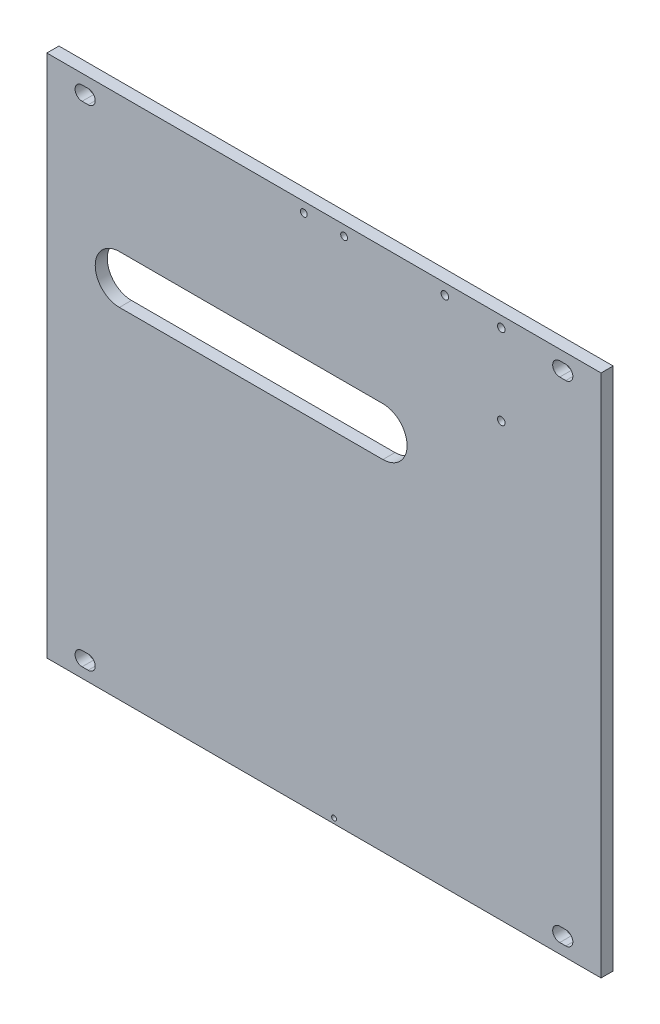
ISO-10303-21;
HEADER;
FILE_DESCRIPTION(('STEP AP214'),'2;1');
FILE_NAME('part.step','',(''),(''),'','','');
FILE_SCHEMA(('AUTOMOTIVE_DESIGN { 1 0 10303 214 1 1 1 1 }'));
ENDSEC;
DATA;
#1=APPLICATION_CONTEXT('core data for automotive mechanical design processes');
#2=APPLICATION_PROTOCOL_DEFINITION('international standard','automotive_design',2000,#1);
#3=PRODUCT_CONTEXT('',#1,'mechanical');
#4=PRODUCT('Part','Part','',(#3));
#5=PRODUCT_RELATED_PRODUCT_CATEGORY('part','',(#4));
#6=PRODUCT_DEFINITION_FORMATION('','',#4);
#7=PRODUCT_DEFINITION_CONTEXT('part definition',#1,'design');
#8=PRODUCT_DEFINITION('design','',#6,#7);
#9=PRODUCT_DEFINITION_SHAPE('','',#8);
#10=(LENGTH_UNIT() NAMED_UNIT(*) SI_UNIT(.MILLI.,.METRE.));
#11=(NAMED_UNIT(*) PLANE_ANGLE_UNIT() SI_UNIT($,.RADIAN.));
#12=(NAMED_UNIT(*) SI_UNIT($,.STERADIAN.) SOLID_ANGLE_UNIT());
#13=UNCERTAINTY_MEASURE_WITH_UNIT(LENGTH_MEASURE(1.E-05),#10,'distance_accuracy_value','');
#14=(GEOMETRIC_REPRESENTATION_CONTEXT(3) GLOBAL_UNCERTAINTY_ASSIGNED_CONTEXT((#13)) GLOBAL_UNIT_ASSIGNED_CONTEXT((#10,
#11,#12)) REPRESENTATION_CONTEXT('',''));
#15=CARTESIAN_POINT('',(0.,0.,0.));
#16=DIRECTION('',(0.,0.,1.));
#17=DIRECTION('',(1.,0.,0.));
#18=AXIS2_PLACEMENT_3D('',#15,#16,#17);
#19=CARTESIAN_POINT('',(137.5,130.,-6.));
#20=DIRECTION('',(1.,0.,0.));
#21=DIRECTION('',(0.,1.,0.));
#22=AXIS2_PLACEMENT_3D('',#19,#20,#21);
#23=PLANE('',#22);
#24=DIRECTION('',(0.,1.,0.));
#25=VECTOR('',#24,1.);
#26=CARTESIAN_POINT('',(137.5,130.,0.));
#27=LINE('',#26,#25);
#28=CARTESIAN_POINT('',(137.5,-130.,0.));
#29=VERTEX_POINT('',#28);
#30=CARTESIAN_POINT('',(137.5,130.,0.));
#31=VERTEX_POINT('',#30);
#32=EDGE_CURVE('E666',#29,#31,#27,.T.);
#33=ORIENTED_EDGE('',*,*,#32,.F.);
#34=DIRECTION('',(0.,0.,1.));
#35=VECTOR('',#34,1.);
#36=CARTESIAN_POINT('',(137.5,-130.,-6.));
#37=LINE('',#36,#35);
#38=CARTESIAN_POINT('',(137.5,-130.,-6.));
#39=VERTEX_POINT('',#38);
#40=EDGE_CURVE('E13',#39,#29,#37,.T.);
#41=ORIENTED_EDGE('',*,*,#40,.F.);
#42=DIRECTION('',(0.,1.,0.));
#43=VECTOR('',#42,1.);
#44=CARTESIAN_POINT('',(137.5,130.,-6.));
#45=LINE('',#44,#43);
#46=CARTESIAN_POINT('',(137.5,130.,-6.));
#47=VERTEX_POINT('',#46);
#48=EDGE_CURVE('E673',#39,#47,#45,.T.);
#49=ORIENTED_EDGE('',*,*,#48,.T.);
#50=DIRECTION('',(0.,0.,1.));
#51=VECTOR('',#50,1.);
#52=CARTESIAN_POINT('',(137.5,130.,-6.));
#53=LINE('',#52,#51);
#54=EDGE_CURVE('E686',#47,#31,#53,.T.);
#55=ORIENTED_EDGE('',*,*,#54,.T.);
#56=EDGE_LOOP('',(#33,#41,#49,#55));
#57=FACE_BOUND('',#56,.T.);
#58=ADVANCED_FACE('F336',(#57),#23,.T.);
#59=CARTESIAN_POINT('',(-137.5,-130.,-6.));
#60=DIRECTION('',(0.,-1.,0.));
#61=DIRECTION('',(0.,0.,-1.));
#62=AXIS2_PLACEMENT_3D('',#59,#60,#61);
#63=PLANE('',#62);
#64=DIRECTION('',(1.,0.,0.));
#65=VECTOR('',#64,1.);
#66=CARTESIAN_POINT('',(-137.5,-130.,0.));
#67=LINE('',#66,#65);
#68=CARTESIAN_POINT('',(-137.5,-130.,0.));
#69=VERTEX_POINT('',#68);
#70=EDGE_CURVE('E677',#69,#29,#67,.T.);
#71=ORIENTED_EDGE('',*,*,#70,.F.);
#72=DIRECTION('',(0.,0.,1.));
#73=VECTOR('',#72,1.);
#74=CARTESIAN_POINT('',(-137.5,-130.,-6.));
#75=LINE('',#74,#73);
#76=CARTESIAN_POINT('',(-137.5,-130.,-6.));
#77=VERTEX_POINT('',#76);
#78=EDGE_CURVE('E344',#77,#69,#75,.T.);
#79=ORIENTED_EDGE('',*,*,#78,.F.);
#80=DIRECTION('',(1.,0.,0.));
#81=VECTOR('',#80,1.);
#82=CARTESIAN_POINT('',(-137.5,-130.,-6.));
#83=LINE('',#82,#81);
#84=EDGE_CURVE('E683',#77,#39,#83,.T.);
#85=ORIENTED_EDGE('',*,*,#84,.T.);
#86=ORIENTED_EDGE('',*,*,#40,.T.);
#87=EDGE_LOOP('',(#71,#79,#85,#86));
#88=FACE_BOUND('',#87,.T.);
#89=ADVANCED_FACE('F737',(#88),#63,.T.);
#90=CARTESIAN_POINT('',(-137.5,130.,-6.));
#91=DIRECTION('',(-1.,0.,0.));
#92=DIRECTION('',(0.,0.,1.));
#93=AXIS2_PLACEMENT_3D('',#90,#91,#92);
#94=PLANE('',#93);
#95=DIRECTION('',(0.,-1.,0.));
#96=VECTOR('',#95,1.);
#97=CARTESIAN_POINT('',(-137.5,130.,0.));
#98=LINE('',#97,#96);
#99=CARTESIAN_POINT('',(-137.5,130.,0.));
#100=VERTEX_POINT('',#99);
#101=EDGE_CURVE('E692',#100,#69,#98,.T.);
#102=ORIENTED_EDGE('',*,*,#101,.F.);
#103=DIRECTION('',(0.,0.,1.));
#104=VECTOR('',#103,1.);
#105=CARTESIAN_POINT('',(-137.5,130.,-6.));
#106=LINE('',#105,#104);
#107=CARTESIAN_POINT('',(-137.5,130.,-6.));
#108=VERTEX_POINT('',#107);
#109=EDGE_CURVE('E698',#108,#100,#106,.T.);
#110=ORIENTED_EDGE('',*,*,#109,.F.);
#111=DIRECTION('',(0.,-1.,0.));
#112=VECTOR('',#111,1.);
#113=CARTESIAN_POINT('',(-137.5,130.,-6.));
#114=LINE('',#113,#112);
#115=EDGE_CURVE('E680',#108,#77,#114,.T.);
#116=ORIENTED_EDGE('',*,*,#115,.T.);
#117=ORIENTED_EDGE('',*,*,#78,.T.);
#118=EDGE_LOOP('',(#102,#110,#116,#117));
#119=FACE_BOUND('',#118,.T.);
#120=ADVANCED_FACE('F735',(#119),#94,.T.);
#121=CARTESIAN_POINT('',(-137.5,130.,-6.));
#122=DIRECTION('',(0.,1.,0.));
#123=DIRECTION('',(0.,0.,1.));
#124=AXIS2_PLACEMENT_3D('',#121,#122,#123);
#125=PLANE('',#124);
#126=DIRECTION('',(-1.,0.,0.));
#127=VECTOR('',#126,1.);
#128=CARTESIAN_POINT('',(-137.5,130.,0.));
#129=LINE('',#128,#127);
#130=EDGE_CURVE('E689',#31,#100,#129,.T.);
#131=ORIENTED_EDGE('',*,*,#130,.F.);
#132=ORIENTED_EDGE('',*,*,#54,.F.);
#133=DIRECTION('',(-1.,0.,0.));
#134=VECTOR('',#133,1.);
#135=CARTESIAN_POINT('',(-137.5,130.,-6.));
#136=LINE('',#135,#134);
#137=EDGE_CURVE('E676',#47,#108,#136,.T.);
#138=ORIENTED_EDGE('',*,*,#137,.T.);
#139=ORIENTED_EDGE('',*,*,#109,.T.);
#140=EDGE_LOOP('',(#131,#132,#138,#139));
#141=FACE_BOUND('',#140,.T.);
#142=ADVANCED_FACE('F731',(#141),#125,.T.);
#143=CARTESIAN_POINT('',(0.,0.,-6.));
#144=DIRECTION('',(0.,0.,1.));
#145=DIRECTION('',(1.,0.,0.));
#146=AXIS2_PLACEMENT_3D('',#143,#144,#145);
#147=PLANE('',#146);
#148=CARTESIAN_POINT('',(-10.,125.,-6.));
#149=DIRECTION('',(0.,0.,-1.));
#150=DIRECTION('',(-1.,0.,0.));
#151=AXIS2_PLACEMENT_3D('',#148,#149,#150);
#152=CIRCLE('',#151,1.69999999999999);
#153=CARTESIAN_POINT('',(-11.7,125.,-6.));
#154=VERTEX_POINT('',#153);
#155=EDGE_CURVE('E1045',#154,#154,#152,.T.);
#156=ORIENTED_EDGE('',*,*,#155,.F.);
#157=EDGE_LOOP('',(#156));
#158=FACE_BOUND('',#157,.T.);
#159=CARTESIAN_POINT('',(10.,125.,-6.));
#160=DIRECTION('',(0.,0.,-1.));
#161=DIRECTION('',(-1.,0.,0.));
#162=AXIS2_PLACEMENT_3D('',#159,#160,#161);
#163=CIRCLE('',#162,1.69999999999999);
#164=CARTESIAN_POINT('',(8.30000000000001,125.,-6.));
#165=VERTEX_POINT('',#164);
#166=EDGE_CURVE('E1047',#165,#165,#163,.T.);
#167=ORIENTED_EDGE('',*,*,#166,.F.);
#168=EDGE_LOOP('',(#167));
#169=FACE_BOUND('',#168,.T.);
#170=CARTESIAN_POINT('',(5.,-127.5,-6.00000000000001));
#171=DIRECTION('',(0.,0.,1.));
#172=DIRECTION('',(1.,0.,0.));
#173=AXIS2_PLACEMENT_3D('',#170,#171,#172);
#174=CIRCLE('',#173,1.20000000000001);
#175=CARTESIAN_POINT('',(6.20000000000001,-127.5,-6.00000000000001));
#176=VERTEX_POINT('',#175);
#177=EDGE_CURVE('E515',#176,#176,#174,.T.);
#178=ORIENTED_EDGE('',*,*,#177,.T.);
#179=EDGE_LOOP('',(#178));
#180=FACE_BOUND('',#179,.T.);
#181=DIRECTION('',(-1.,0.,0.));
#182=VECTOR('',#181,1.);
#183=CARTESIAN_POINT('',(120.,-118.,-6.00000000000001));
#184=LINE('',#183,#182);
#185=CARTESIAN_POINT('',(120.,-118.,-6.));
#186=VERTEX_POINT('',#185);
#187=CARTESIAN_POINT('',(117.,-118.,-6.00000000000001));
#188=VERTEX_POINT('',#187);
#189=EDGE_CURVE('E499',#186,#188,#184,.T.);
#190=ORIENTED_EDGE('',*,*,#189,.T.);
#191=CARTESIAN_POINT('',(117.,-121.5,-6.00000000000001));
#192=DIRECTION('',(0.,0.,1.));
#193=DIRECTION('',(1.,0.,0.));
#194=AXIS2_PLACEMENT_3D('',#191,#192,#193);
#195=CIRCLE('',#194,3.49999999999999);
#196=CARTESIAN_POINT('',(117.,-125.,-6.00000000000001));
#197=VERTEX_POINT('',#196);
#198=EDGE_CURVE('E529',#188,#197,#195,.T.);
#199=ORIENTED_EDGE('',*,*,#198,.T.);
#200=DIRECTION('',(-1.,0.,0.));
#201=VECTOR('',#200,1.);
#202=CARTESIAN_POINT('',(120.,-125.,-6.00000000000001));
#203=LINE('',#202,#201);
#204=CARTESIAN_POINT('',(120.,-125.,-6.00000000000001));
#205=VERTEX_POINT('',#204);
#206=EDGE_CURVE('E517',#205,#197,#203,.T.);
#207=ORIENTED_EDGE('',*,*,#206,.F.);
#208=CARTESIAN_POINT('',(120.,-121.5,-6.00000000000001));
#209=DIRECTION('',(0.,0.,1.));
#210=DIRECTION('',(1.,0.,0.));
#211=AXIS2_PLACEMENT_3D('',#208,#209,#210);
#212=CIRCLE('',#211,3.49999999999999);
#213=EDGE_CURVE('E501',#205,#186,#212,.T.);
#214=ORIENTED_EDGE('',*,*,#213,.T.);
#215=EDGE_LOOP('',(#190,#199,#207,#214));
#216=FACE_BOUND('',#215,.T.);
#217=DIRECTION('',(-1.,0.,0.));
#218=VECTOR('',#217,1.);
#219=CARTESIAN_POINT('',(-117.,-118.,-6.00000000000001));
#220=LINE('',#219,#218);
#221=CARTESIAN_POINT('',(-117.,-118.,-6.));
#222=VERTEX_POINT('',#221);
#223=CARTESIAN_POINT('',(-120.,-118.,-6.00000000000001));
#224=VERTEX_POINT('',#223);
#225=EDGE_CURVE('E538',#222,#224,#220,.T.);
#226=ORIENTED_EDGE('',*,*,#225,.T.);
#227=CARTESIAN_POINT('',(-120.,-121.5,-6.00000000000001));
#228=DIRECTION('',(0.,0.,1.));
#229=DIRECTION('',(1.,0.,0.));
#230=AXIS2_PLACEMENT_3D('',#227,#228,#229);
#231=CIRCLE('',#230,3.49999999999999);
#232=CARTESIAN_POINT('',(-120.,-125.,-6.00000000000001));
#233=VERTEX_POINT('',#232);
#234=EDGE_CURVE('E559',#224,#233,#231,.T.);
#235=ORIENTED_EDGE('',*,*,#234,.T.);
#236=DIRECTION('',(-1.,0.,0.));
#237=VECTOR('',#236,1.);
#238=CARTESIAN_POINT('',(-117.,-125.,-6.00000000000001));
#239=LINE('',#238,#237);
#240=CARTESIAN_POINT('',(-117.,-125.,-6.00000000000001));
#241=VERTEX_POINT('',#240);
#242=EDGE_CURVE('E541',#241,#233,#239,.T.);
#243=ORIENTED_EDGE('',*,*,#242,.F.);
#244=CARTESIAN_POINT('',(-117.,-121.5,-6.00000000000001));
#245=DIRECTION('',(0.,0.,1.));
#246=DIRECTION('',(1.,0.,0.));
#247=AXIS2_PLACEMENT_3D('',#244,#245,#246);
#248=CIRCLE('',#247,3.49999999999999);
#249=EDGE_CURVE('E549',#241,#222,#248,.T.);
#250=ORIENTED_EDGE('',*,*,#249,.T.);
#251=EDGE_LOOP('',(#226,#235,#243,#250));
#252=FACE_BOUND('',#251,.T.);
#253=DIRECTION('',(-1.,0.,0.));
#254=VECTOR('',#253,1.);
#255=CARTESIAN_POINT('',(-117.,125.,-6.00000000000001));
#256=LINE('',#255,#254);
#257=CARTESIAN_POINT('',(-117.,125.,-6.00000000000001));
#258=VERTEX_POINT('',#257);
#259=CARTESIAN_POINT('',(-120.,125.,-6.00000000000001));
#260=VERTEX_POINT('',#259);
#261=EDGE_CURVE('E568',#258,#260,#256,.T.);
#262=ORIENTED_EDGE('',*,*,#261,.T.);
#263=CARTESIAN_POINT('',(-120.,121.5,-6.00000000000001));
#264=DIRECTION('',(0.,0.,1.));
#265=DIRECTION('',(1.,0.,0.));
#266=AXIS2_PLACEMENT_3D('',#263,#264,#265);
#267=CIRCLE('',#266,3.49999999999999);
#268=CARTESIAN_POINT('',(-120.,118.,-6.00000000000001));
#269=VERTEX_POINT('',#268);
#270=EDGE_CURVE('E590',#260,#269,#267,.T.);
#271=ORIENTED_EDGE('',*,*,#270,.T.);
#272=DIRECTION('',(-1.,0.,0.));
#273=VECTOR('',#272,1.);
#274=CARTESIAN_POINT('',(-117.,118.,-6.00000000000001));
#275=LINE('',#274,#273);
#276=CARTESIAN_POINT('',(-117.,118.,-6.));
#277=VERTEX_POINT('',#276);
#278=EDGE_CURVE('E571',#277,#269,#275,.T.);
#279=ORIENTED_EDGE('',*,*,#278,.F.);
#280=CARTESIAN_POINT('',(-117.,121.5,-6.00000000000001));
#281=DIRECTION('',(0.,0.,1.));
#282=DIRECTION('',(1.,0.,0.));
#283=AXIS2_PLACEMENT_3D('',#280,#281,#282);
#284=CIRCLE('',#283,3.49999999999999);
#285=EDGE_CURVE('E578',#277,#258,#284,.T.);
#286=ORIENTED_EDGE('',*,*,#285,.T.);
#287=EDGE_LOOP('',(#262,#271,#279,#286));
#288=FACE_BOUND('',#287,.T.);
#289=CARTESIAN_POINT('',(120.,121.5,-6.00000000000001));
#290=DIRECTION('',(0.,0.,1.));
#291=DIRECTION('',(1.,0.,0.));
#292=AXIS2_PLACEMENT_3D('',#289,#290,#291);
#293=CIRCLE('',#292,3.49999999999999);
#294=CARTESIAN_POINT('',(120.,118.,-6.00000000000001));
#295=VERTEX_POINT('',#294);
#296=CARTESIAN_POINT('',(120.,125.,-6.00000000000001));
#297=VERTEX_POINT('',#296);
#298=EDGE_CURVE('E611',#295,#297,#293,.T.);
#299=ORIENTED_EDGE('',*,*,#298,.T.);
#300=DIRECTION('',(-1.,0.,0.));
#301=VECTOR('',#300,1.);
#302=CARTESIAN_POINT('',(120.,125.,-6.00000000000001));
#303=LINE('',#302,#301);
#304=CARTESIAN_POINT('',(117.,125.,-6.00000000000001));
#305=VERTEX_POINT('',#304);
#306=EDGE_CURVE('E600',#297,#305,#303,.T.);
#307=ORIENTED_EDGE('',*,*,#306,.T.);
#308=CARTESIAN_POINT('',(117.,121.5,-6.00000000000001));
#309=DIRECTION('',(0.,0.,1.));
#310=DIRECTION('',(1.,0.,0.));
#311=AXIS2_PLACEMENT_3D('',#308,#309,#310);
#312=CIRCLE('',#311,3.49999999999999);
#313=CARTESIAN_POINT('',(117.,118.,-6.00000000000001));
#314=VERTEX_POINT('',#313);
#315=EDGE_CURVE('E622',#305,#314,#312,.T.);
#316=ORIENTED_EDGE('',*,*,#315,.T.);
#317=DIRECTION('',(-1.,0.,0.));
#318=VECTOR('',#317,1.);
#319=CARTESIAN_POINT('',(120.,118.,-6.00000000000001));
#320=LINE('',#319,#318);
#321=EDGE_CURVE('E603',#295,#314,#320,.T.);
#322=ORIENTED_EDGE('',*,*,#321,.F.);
#323=EDGE_LOOP('',(#299,#307,#316,#322));
#324=FACE_BOUND('',#323,.T.);
#325=CARTESIAN_POINT('',(88.,124.63,-6.));
#326=DIRECTION('',(0.,0.,1.));
#327=DIRECTION('',(1.,0.,0.));
#328=AXIS2_PLACEMENT_3D('',#325,#326,#327);
#329=CIRCLE('',#328,1.875);
#330=CARTESIAN_POINT('',(89.875,124.63,-6.));
#331=VERTEX_POINT('',#330);
#332=EDGE_CURVE('E630',#331,#331,#329,.T.);
#333=ORIENTED_EDGE('',*,*,#332,.T.);
#334=EDGE_LOOP('',(#333));
#335=FACE_BOUND('',#334,.T.);
#336=CARTESIAN_POINT('',(60.,124.63,-6.));
#337=DIRECTION('',(0.,0.,1.));
#338=DIRECTION('',(1.,0.,0.));
#339=AXIS2_PLACEMENT_3D('',#336,#337,#338);
#340=CIRCLE('',#339,1.87499999999999);
#341=CARTESIAN_POINT('',(61.875,124.63,-6.));
#342=VERTEX_POINT('',#341);
#343=EDGE_CURVE('E629',#342,#342,#340,.T.);
#344=ORIENTED_EDGE('',*,*,#343,.T.);
#345=EDGE_LOOP('',(#344));
#346=FACE_BOUND('',#345,.T.);
#347=CARTESIAN_POINT('',(88.,84.63,-6.));
#348=DIRECTION('',(0.,0.,1.));
#349=DIRECTION('',(1.,0.,0.));
#350=AXIS2_PLACEMENT_3D('',#347,#348,#349);
#351=CIRCLE('',#350,1.875);
#352=CARTESIAN_POINT('',(89.875,84.63,-6.));
#353=VERTEX_POINT('',#352);
#354=EDGE_CURVE('E636',#353,#353,#351,.T.);
#355=ORIENTED_EDGE('',*,*,#354,.T.);
#356=EDGE_LOOP('',(#355));
#357=FACE_BOUND('',#356,.T.);
#358=CARTESIAN_POINT('',(29.25,50.67,-6.));
#359=DIRECTION('',(0.,0.,1.));
#360=DIRECTION('',(1.,0.,0.));
#361=AXIS2_PLACEMENT_3D('',#358,#359,#360);
#362=CIRCLE('',#361,12.);
#363=CARTESIAN_POINT('',(29.25,38.67,-6.));
#364=VERTEX_POINT('',#363);
#365=CARTESIAN_POINT('',(29.25,62.67,-6.));
#366=VERTEX_POINT('',#365);
#367=EDGE_CURVE('E650',#364,#366,#362,.T.);
#368=ORIENTED_EDGE('',*,*,#367,.T.);
#369=DIRECTION('',(-1.,0.,0.));
#370=VECTOR('',#369,1.);
#371=CARTESIAN_POINT('',(0.,62.67,-6.));
#372=LINE('',#371,#370);
#373=CARTESIAN_POINT('',(-101.5,62.67,-6.));
#374=VERTEX_POINT('',#373);
#375=EDGE_CURVE('E640',#366,#374,#372,.T.);
#376=ORIENTED_EDGE('',*,*,#375,.T.);
#377=CARTESIAN_POINT('',(-101.5,50.67,-6.));
#378=DIRECTION('',(0.,0.,1.));
#379=DIRECTION('',(1.,0.,0.));
#380=AXIS2_PLACEMENT_3D('',#377,#378,#379);
#381=CIRCLE('',#380,12.);
#382=CARTESIAN_POINT('',(-101.5,38.67,-6.));
#383=VERTEX_POINT('',#382);
#384=EDGE_CURVE('E643',#374,#383,#381,.T.);
#385=ORIENTED_EDGE('',*,*,#384,.T.);
#386=DIRECTION('',(1.,0.,0.));
#387=VECTOR('',#386,1.);
#388=CARTESIAN_POINT('',(0.,38.67,-6.));
#389=LINE('',#388,#387);
#390=EDGE_CURVE('E647',#383,#364,#389,.T.);
#391=ORIENTED_EDGE('',*,*,#390,.T.);
#392=EDGE_LOOP('',(#368,#376,#385,#391));
#393=FACE_BOUND('',#392,.T.);
#394=ORIENTED_EDGE('',*,*,#48,.F.);
#395=ORIENTED_EDGE('',*,*,#84,.F.);
#396=ORIENTED_EDGE('',*,*,#115,.F.);
#397=ORIENTED_EDGE('',*,*,#137,.F.);
#398=EDGE_LOOP('',(#394,#395,#396,#397));
#399=FACE_BOUND('',#398,.T.);
#400=ADVANCED_FACE('F714',(#158,#169,#180,#216,#252,#288,#324,#335,#346,#357,#393,#399),#147,.F.);
#401=CARTESIAN_POINT('',(0.,0.,0.));
#402=DIRECTION('',(0.,0.,1.));
#403=DIRECTION('',(1.,0.,0.));
#404=AXIS2_PLACEMENT_3D('',#401,#402,#403);
#405=PLANE('',#404);
#406=CARTESIAN_POINT('',(-10.,125.,0.));
#407=DIRECTION('',(0.,0.,-1.));
#408=DIRECTION('',(-1.,0.,0.));
#409=AXIS2_PLACEMENT_3D('',#406,#407,#408);
#410=CIRCLE('',#409,1.69999999999999);
#411=CARTESIAN_POINT('',(-11.7,125.,0.));
#412=VERTEX_POINT('',#411);
#413=EDGE_CURVE('E1043',#412,#412,#410,.T.);
#414=ORIENTED_EDGE('',*,*,#413,.T.);
#415=EDGE_LOOP('',(#414));
#416=FACE_BOUND('',#415,.T.);
#417=CARTESIAN_POINT('',(10.,125.,0.));
#418=DIRECTION('',(0.,0.,-1.));
#419=DIRECTION('',(-1.,0.,0.));
#420=AXIS2_PLACEMENT_3D('',#417,#418,#419);
#421=CIRCLE('',#420,1.69999999999999);
#422=CARTESIAN_POINT('',(8.30000000000001,125.,0.));
#423=VERTEX_POINT('',#422);
#424=EDGE_CURVE('E1052',#423,#423,#421,.T.);
#425=ORIENTED_EDGE('',*,*,#424,.T.);
#426=EDGE_LOOP('',(#425));
#427=FACE_BOUND('',#426,.T.);
#428=CARTESIAN_POINT('',(5.,-127.5,0.));
#429=DIRECTION('',(0.,0.,1.));
#430=DIRECTION('',(1.,0.,0.));
#431=AXIS2_PLACEMENT_3D('',#428,#429,#430);
#432=CIRCLE('',#431,1.20000000000001);
#433=CARTESIAN_POINT('',(6.20000000000001,-127.5,0.));
#434=VERTEX_POINT('',#433);
#435=EDGE_CURVE('E520',#434,#434,#432,.T.);
#436=ORIENTED_EDGE('',*,*,#435,.F.);
#437=EDGE_LOOP('',(#436));
#438=FACE_BOUND('',#437,.T.);
#439=CARTESIAN_POINT('',(117.,-121.5,0.));
#440=DIRECTION('',(0.,0.,1.));
#441=DIRECTION('',(1.,0.,0.));
#442=AXIS2_PLACEMENT_3D('',#439,#440,#441);
#443=CIRCLE('',#442,3.49999999999999);
#444=CARTESIAN_POINT('',(117.,-118.,0.));
#445=VERTEX_POINT('',#444);
#446=CARTESIAN_POINT('',(117.,-125.,0.));
#447=VERTEX_POINT('',#446);
#448=EDGE_CURVE('E514',#445,#447,#443,.T.);
#449=ORIENTED_EDGE('',*,*,#448,.F.);
#450=DIRECTION('',(-1.,0.,0.));
#451=VECTOR('',#450,1.);
#452=CARTESIAN_POINT('',(120.,-118.,0.));
#453=LINE('',#452,#451);
#454=CARTESIAN_POINT('',(120.,-118.,0.));
#455=VERTEX_POINT('',#454);
#456=EDGE_CURVE('E496',#455,#445,#453,.T.);
#457=ORIENTED_EDGE('',*,*,#456,.F.);
#458=CARTESIAN_POINT('',(120.,-121.5,0.));
#459=DIRECTION('',(0.,0.,1.));
#460=DIRECTION('',(1.,0.,0.));
#461=AXIS2_PLACEMENT_3D('',#458,#459,#460);
#462=CIRCLE('',#461,3.49999999999999);
#463=CARTESIAN_POINT('',(120.,-125.,0.));
#464=VERTEX_POINT('',#463);
#465=EDGE_CURVE('E504',#464,#455,#462,.T.);
#466=ORIENTED_EDGE('',*,*,#465,.F.);
#467=DIRECTION('',(-1.,0.,0.));
#468=VECTOR('',#467,1.);
#469=CARTESIAN_POINT('',(120.,-125.,0.));
#470=LINE('',#469,#468);
#471=EDGE_CURVE('E508',#464,#447,#470,.T.);
#472=ORIENTED_EDGE('',*,*,#471,.T.);
#473=EDGE_LOOP('',(#449,#457,#466,#472));
#474=FACE_BOUND('',#473,.T.);
#475=CARTESIAN_POINT('',(-120.,-121.5,0.));
#476=DIRECTION('',(0.,0.,1.));
#477=DIRECTION('',(1.,0.,0.));
#478=AXIS2_PLACEMENT_3D('',#475,#476,#477);
#479=CIRCLE('',#478,3.49999999999999);
#480=CARTESIAN_POINT('',(-120.,-118.,0.));
#481=VERTEX_POINT('',#480);
#482=CARTESIAN_POINT('',(-120.,-125.,0.));
#483=VERTEX_POINT('',#482);
#484=EDGE_CURVE('E556',#481,#483,#479,.T.);
#485=ORIENTED_EDGE('',*,*,#484,.F.);
#486=DIRECTION('',(-1.,0.,0.));
#487=VECTOR('',#486,1.);
#488=CARTESIAN_POINT('',(-117.,-118.,0.));
#489=LINE('',#488,#487);
#490=CARTESIAN_POINT('',(-117.,-118.,0.));
#491=VERTEX_POINT('',#490);
#492=EDGE_CURVE('E536',#491,#481,#489,.T.);
#493=ORIENTED_EDGE('',*,*,#492,.F.);
#494=CARTESIAN_POINT('',(-117.,-121.5,0.));
#495=DIRECTION('',(0.,0.,1.));
#496=DIRECTION('',(1.,0.,0.));
#497=AXIS2_PLACEMENT_3D('',#494,#495,#496);
#498=CIRCLE('',#497,3.49999999999999);
#499=CARTESIAN_POINT('',(-117.,-125.,0.));
#500=VERTEX_POINT('',#499);
#501=EDGE_CURVE('E546',#500,#491,#498,.T.);
#502=ORIENTED_EDGE('',*,*,#501,.F.);
#503=DIRECTION('',(-1.,0.,0.));
#504=VECTOR('',#503,1.);
#505=CARTESIAN_POINT('',(-117.,-125.,0.));
#506=LINE('',#505,#504);
#507=EDGE_CURVE('E543',#500,#483,#506,.T.);
#508=ORIENTED_EDGE('',*,*,#507,.T.);
#509=EDGE_LOOP('',(#485,#493,#502,#508));
#510=FACE_BOUND('',#509,.T.);
#511=CARTESIAN_POINT('',(-120.,121.5,0.));
#512=DIRECTION('',(0.,0.,1.));
#513=DIRECTION('',(1.,0.,0.));
#514=AXIS2_PLACEMENT_3D('',#511,#512,#513);
#515=CIRCLE('',#514,3.49999999999999);
#516=CARTESIAN_POINT('',(-120.,125.,0.));
#517=VERTEX_POINT('',#516);
#518=CARTESIAN_POINT('',(-120.,118.,0.));
#519=VERTEX_POINT('',#518);
#520=EDGE_CURVE('E587',#517,#519,#515,.T.);
#521=ORIENTED_EDGE('',*,*,#520,.F.);
#522=DIRECTION('',(-1.,0.,0.));
#523=VECTOR('',#522,1.);
#524=CARTESIAN_POINT('',(-117.,125.,0.));
#525=LINE('',#524,#523);
#526=CARTESIAN_POINT('',(-117.,125.,0.));
#527=VERTEX_POINT('',#526);
#528=EDGE_CURVE('E566',#527,#517,#525,.T.);
#529=ORIENTED_EDGE('',*,*,#528,.F.);
#530=CARTESIAN_POINT('',(-117.,121.5,0.));
#531=DIRECTION('',(0.,0.,1.));
#532=DIRECTION('',(1.,0.,0.));
#533=AXIS2_PLACEMENT_3D('',#530,#531,#532);
#534=CIRCLE('',#533,3.49999999999999);
#535=CARTESIAN_POINT('',(-117.,118.,0.));
#536=VERTEX_POINT('',#535);
#537=EDGE_CURVE('E576',#536,#527,#534,.T.);
#538=ORIENTED_EDGE('',*,*,#537,.F.);
#539=DIRECTION('',(-1.,0.,0.));
#540=VECTOR('',#539,1.);
#541=CARTESIAN_POINT('',(-117.,118.,0.));
#542=LINE('',#541,#540);
#543=EDGE_CURVE('E573',#536,#519,#542,.T.);
#544=ORIENTED_EDGE('',*,*,#543,.T.);
#545=EDGE_LOOP('',(#521,#529,#538,#544));
#546=FACE_BOUND('',#545,.T.);
#547=CARTESIAN_POINT('',(120.,121.5,0.));
#548=DIRECTION('',(0.,0.,1.));
#549=DIRECTION('',(1.,0.,0.));
#550=AXIS2_PLACEMENT_3D('',#547,#548,#549);
#551=CIRCLE('',#550,3.49999999999999);
#552=CARTESIAN_POINT('',(120.,118.,0.));
#553=VERTEX_POINT('',#552);
#554=CARTESIAN_POINT('',(120.,125.,0.));
#555=VERTEX_POINT('',#554);
#556=EDGE_CURVE('E608',#553,#555,#551,.T.);
#557=ORIENTED_EDGE('',*,*,#556,.F.);
#558=DIRECTION('',(-1.,0.,0.));
#559=VECTOR('',#558,1.);
#560=CARTESIAN_POINT('',(120.,118.,0.));
#561=LINE('',#560,#559);
#562=CARTESIAN_POINT('',(117.,118.,0.));
#563=VERTEX_POINT('',#562);
#564=EDGE_CURVE('E605',#553,#563,#561,.T.);
#565=ORIENTED_EDGE('',*,*,#564,.T.);
#566=CARTESIAN_POINT('',(117.,121.5,0.));
#567=DIRECTION('',(0.,0.,1.));
#568=DIRECTION('',(1.,0.,0.));
#569=AXIS2_PLACEMENT_3D('',#566,#567,#568);
#570=CIRCLE('',#569,3.49999999999999);
#571=CARTESIAN_POINT('',(117.,125.,0.));
#572=VERTEX_POINT('',#571);
#573=EDGE_CURVE('E619',#572,#563,#570,.T.);
#574=ORIENTED_EDGE('',*,*,#573,.F.);
#575=DIRECTION('',(-1.,0.,0.));
#576=VECTOR('',#575,1.);
#577=CARTESIAN_POINT('',(120.,125.,0.));
#578=LINE('',#577,#576);
#579=EDGE_CURVE('E597',#555,#572,#578,.T.);
#580=ORIENTED_EDGE('',*,*,#579,.F.);
#581=EDGE_LOOP('',(#557,#565,#574,#580));
#582=FACE_BOUND('',#581,.T.);
#583=CARTESIAN_POINT('',(88.,124.63,0.));
#584=DIRECTION('',(0.,0.,1.));
#585=DIRECTION('',(1.,0.,0.));
#586=AXIS2_PLACEMENT_3D('',#583,#584,#585);
#587=CIRCLE('',#586,1.875);
#588=CARTESIAN_POINT('',(89.875,124.63,0.));
#589=VERTEX_POINT('',#588);
#590=EDGE_CURVE('E339',#589,#589,#587,.T.);
#591=ORIENTED_EDGE('',*,*,#590,.F.);
#592=EDGE_LOOP('',(#591));
#593=FACE_BOUND('',#592,.T.);
#594=CARTESIAN_POINT('',(60.,124.63,0.));
#595=DIRECTION('',(0.,0.,1.));
#596=DIRECTION('',(1.,0.,0.));
#597=AXIS2_PLACEMENT_3D('',#594,#595,#596);
#598=CIRCLE('',#597,1.87499999999999);
#599=CARTESIAN_POINT('',(61.875,124.63,0.));
#600=VERTEX_POINT('',#599);
#601=EDGE_CURVE('E633',#600,#600,#598,.T.);
#602=ORIENTED_EDGE('',*,*,#601,.F.);
#603=EDGE_LOOP('',(#602));
#604=FACE_BOUND('',#603,.T.);
#605=CARTESIAN_POINT('',(88.,84.63,0.));
#606=DIRECTION('',(0.,0.,1.));
#607=DIRECTION('',(1.,0.,0.));
#608=AXIS2_PLACEMENT_3D('',#605,#606,#607);
#609=CIRCLE('',#608,1.875);
#610=CARTESIAN_POINT('',(89.875,84.63,0.));
#611=VERTEX_POINT('',#610);
#612=EDGE_CURVE('E639',#611,#611,#609,.T.);
#613=ORIENTED_EDGE('',*,*,#612,.F.);
#614=EDGE_LOOP('',(#613));
#615=FACE_BOUND('',#614,.T.);
#616=DIRECTION('',(-1.,0.,0.));
#617=VECTOR('',#616,1.);
#618=CARTESIAN_POINT('',(0.,62.67,0.));
#619=LINE('',#618,#617);
#620=CARTESIAN_POINT('',(29.25,62.67,0.));
#621=VERTEX_POINT('',#620);
#622=CARTESIAN_POINT('',(-101.5,62.67,0.));
#623=VERTEX_POINT('',#622);
#624=EDGE_CURVE('E654',#621,#623,#619,.T.);
#625=ORIENTED_EDGE('',*,*,#624,.F.);
#626=CARTESIAN_POINT('',(29.25,50.67,0.));
#627=DIRECTION('',(0.,0.,1.));
#628=DIRECTION('',(1.,0.,0.));
#629=AXIS2_PLACEMENT_3D('',#626,#627,#628);
#630=CIRCLE('',#629,12.);
#631=CARTESIAN_POINT('',(29.25,38.67,0.));
#632=VERTEX_POINT('',#631);
#633=EDGE_CURVE('E644',#632,#621,#630,.T.);
#634=ORIENTED_EDGE('',*,*,#633,.F.);
#635=DIRECTION('',(1.,0.,0.));
#636=VECTOR('',#635,1.);
#637=CARTESIAN_POINT('',(0.,38.67,0.));
#638=LINE('',#637,#636);
#639=CARTESIAN_POINT('',(-101.5,38.67,0.));
#640=VERTEX_POINT('',#639);
#641=EDGE_CURVE('E659',#640,#632,#638,.T.);
#642=ORIENTED_EDGE('',*,*,#641,.F.);
#643=CARTESIAN_POINT('',(-101.5,50.67,0.));
#644=DIRECTION('',(0.,0.,1.));
#645=DIRECTION('',(1.,0.,0.));
#646=AXIS2_PLACEMENT_3D('',#643,#644,#645);
#647=CIRCLE('',#646,12.);
#648=EDGE_CURVE('E656',#623,#640,#647,.T.);
#649=ORIENTED_EDGE('',*,*,#648,.F.);
#650=EDGE_LOOP('',(#625,#634,#642,#649));
#651=FACE_BOUND('',#650,.T.);
#652=ORIENTED_EDGE('',*,*,#32,.T.);
#653=ORIENTED_EDGE('',*,*,#130,.T.);
#654=ORIENTED_EDGE('',*,*,#101,.T.);
#655=ORIENTED_EDGE('',*,*,#70,.T.);
#656=EDGE_LOOP('',(#652,#653,#654,#655));
#657=FACE_BOUND('',#656,.T.);
#658=ADVANCED_FACE('F511',(#416,#427,#438,#474,#510,#546,#582,#593,#604,#615,#651,#657),#405,.T.);
#659=CARTESIAN_POINT('',(0.,62.67,-6.));
#660=DIRECTION('',(0.,1.,0.));
#661=DIRECTION('',(-1.,0.,0.));
#662=AXIS2_PLACEMENT_3D('',#659,#660,#661);
#663=PLANE('',#662);
#664=ORIENTED_EDGE('',*,*,#624,.T.);
#665=DIRECTION('',(0.,0.,1.));
#666=VECTOR('',#665,1.);
#667=CARTESIAN_POINT('',(-101.5,62.67,-6.));
#668=LINE('',#667,#666);
#669=EDGE_CURVE('E653',#374,#623,#668,.T.);
#670=ORIENTED_EDGE('',*,*,#669,.F.);
#671=ORIENTED_EDGE('',*,*,#375,.F.);
#672=DIRECTION('',(0.,0.,1.));
#673=VECTOR('',#672,1.);
#674=CARTESIAN_POINT('',(29.25,62.67,-6.));
#675=LINE('',#674,#673);
#676=EDGE_CURVE('E664',#366,#621,#675,.T.);
#677=ORIENTED_EDGE('',*,*,#676,.T.);
#678=EDGE_LOOP('',(#664,#670,#671,#677));
#679=FACE_BOUND('',#678,.T.);
#680=ADVANCED_FACE('F713',(#679),#663,.F.);
#681=CARTESIAN_POINT('',(29.25,50.67,-6.));
#682=DIRECTION('',(0.,0.,1.));
#683=DIRECTION('',(1.,0.,0.));
#684=AXIS2_PLACEMENT_3D('',#681,#682,#683);
#685=CYLINDRICAL_SURFACE('',#684,12.);
#686=ORIENTED_EDGE('',*,*,#633,.T.);
#687=ORIENTED_EDGE('',*,*,#676,.F.);
#688=ORIENTED_EDGE('',*,*,#367,.F.);
#689=DIRECTION('',(0.,0.,1.));
#690=VECTOR('',#689,1.);
#691=CARTESIAN_POINT('',(29.25,38.67,-6.));
#692=LINE('',#691,#690);
#693=EDGE_CURVE('E667',#364,#632,#692,.T.);
#694=ORIENTED_EDGE('',*,*,#693,.T.);
#695=EDGE_LOOP('',(#686,#687,#688,#694));
#696=FACE_BOUND('',#695,.T.);
#697=ADVANCED_FACE('F775',(#696),#685,.F.);
#698=CARTESIAN_POINT('',(0.,38.67,-6.));
#699=DIRECTION('',(0.,-1.,0.));
#700=DIRECTION('',(0.,0.,-1.));
#701=AXIS2_PLACEMENT_3D('',#698,#699,#700);
#702=PLANE('',#701);
#703=ORIENTED_EDGE('',*,*,#641,.T.);
#704=ORIENTED_EDGE('',*,*,#693,.F.);
#705=ORIENTED_EDGE('',*,*,#390,.F.);
#706=DIRECTION('',(0.,0.,1.));
#707=VECTOR('',#706,1.);
#708=CARTESIAN_POINT('',(-101.5,38.67,-6.));
#709=LINE('',#708,#707);
#710=EDGE_CURVE('E669',#383,#640,#709,.T.);
#711=ORIENTED_EDGE('',*,*,#710,.T.);
#712=EDGE_LOOP('',(#703,#704,#705,#711));
#713=FACE_BOUND('',#712,.T.);
#714=ADVANCED_FACE('F786',(#713),#702,.F.);
#715=CARTESIAN_POINT('',(-101.5,50.67,-6.));
#716=DIRECTION('',(0.,0.,1.));
#717=DIRECTION('',(1.,0.,0.));
#718=AXIS2_PLACEMENT_3D('',#715,#716,#717);
#719=CYLINDRICAL_SURFACE('',#718,12.);
#720=ORIENTED_EDGE('',*,*,#648,.T.);
#721=ORIENTED_EDGE('',*,*,#710,.F.);
#722=ORIENTED_EDGE('',*,*,#384,.F.);
#723=ORIENTED_EDGE('',*,*,#669,.T.);
#724=EDGE_LOOP('',(#720,#721,#722,#723));
#725=FACE_BOUND('',#724,.T.);
#726=ADVANCED_FACE('F797',(#725),#719,.F.);
#727=CARTESIAN_POINT('',(88.,84.63,-6.));
#728=DIRECTION('',(0.,0.,1.));
#729=DIRECTION('',(1.,0.,0.));
#730=AXIS2_PLACEMENT_3D('',#727,#728,#729);
#731=CYLINDRICAL_SURFACE('',#730,1.875);
#732=ORIENTED_EDGE('',*,*,#612,.T.);
#733=EDGE_LOOP('',(#732));
#734=FACE_BOUND('',#733,.T.);
#735=ORIENTED_EDGE('',*,*,#354,.F.);
#736=EDGE_LOOP('',(#735));
#737=FACE_BOUND('',#736,.T.);
#738=ADVANCED_FACE('F808',(#734,#737),#731,.F.);
#739=CARTESIAN_POINT('',(60.,124.63,-6.));
#740=DIRECTION('',(0.,0.,1.));
#741=DIRECTION('',(1.,0.,0.));
#742=AXIS2_PLACEMENT_3D('',#739,#740,#741);
#743=CYLINDRICAL_SURFACE('',#742,1.87499999999999);
#744=ORIENTED_EDGE('',*,*,#601,.T.);
#745=EDGE_LOOP('',(#744));
#746=FACE_BOUND('',#745,.T.);
#747=ORIENTED_EDGE('',*,*,#343,.F.);
#748=EDGE_LOOP('',(#747));
#749=FACE_BOUND('',#748,.T.);
#750=ADVANCED_FACE('F819',(#746,#749),#743,.F.);
#751=CARTESIAN_POINT('',(88.,124.63,-6.));
#752=DIRECTION('',(0.,0.,1.));
#753=DIRECTION('',(1.,0.,0.));
#754=AXIS2_PLACEMENT_3D('',#751,#752,#753);
#755=CYLINDRICAL_SURFACE('',#754,1.875);
#756=ORIENTED_EDGE('',*,*,#590,.T.);
#757=EDGE_LOOP('',(#756));
#758=FACE_BOUND('',#757,.T.);
#759=ORIENTED_EDGE('',*,*,#332,.F.);
#760=EDGE_LOOP('',(#759));
#761=FACE_BOUND('',#760,.T.);
#762=ADVANCED_FACE('F708',(#758,#761),#755,.F.);
#763=CARTESIAN_POINT('',(117.,121.5,0.));
#764=DIRECTION('',(0.,0.,1.));
#765=DIRECTION('',(1.,0.,0.));
#766=AXIS2_PLACEMENT_3D('',#763,#764,#765);
#767=CYLINDRICAL_SURFACE('',#766,3.49999999999999);
#768=ORIENTED_EDGE('',*,*,#573,.T.);
#769=DIRECTION('',(0.,0.,1.));
#770=VECTOR('',#769,1.);
#771=CARTESIAN_POINT('',(117.,118.,0.));
#772=LINE('',#771,#770);
#773=EDGE_CURVE('E625',#314,#563,#772,.T.);
#774=ORIENTED_EDGE('',*,*,#773,.F.);
#775=ORIENTED_EDGE('',*,*,#315,.F.);
#776=DIRECTION('',(0.,0.,1.));
#777=VECTOR('',#776,1.);
#778=CARTESIAN_POINT('',(117.,125.,0.));
#779=LINE('',#778,#777);
#780=EDGE_CURVE('E627',#572,#305,#779,.F.);
#781=ORIENTED_EDGE('',*,*,#780,.F.);
#782=EDGE_LOOP('',(#768,#774,#775,#781));
#783=FACE_BOUND('',#782,.T.);
#784=ADVANCED_FACE('F839',(#783),#767,.F.);
#785=CARTESIAN_POINT('',(120.,121.5,0.));
#786=DIRECTION('',(0.,0.,1.));
#787=DIRECTION('',(1.,0.,0.));
#788=AXIS2_PLACEMENT_3D('',#785,#786,#787);
#789=CYLINDRICAL_SURFACE('',#788,3.49999999999999);
#790=ORIENTED_EDGE('',*,*,#556,.T.);
#791=DIRECTION('',(0.,0.,1.));
#792=VECTOR('',#791,1.);
#793=CARTESIAN_POINT('',(120.,125.,0.));
#794=LINE('',#793,#792);
#795=EDGE_CURVE('E614',#297,#555,#794,.T.);
#796=ORIENTED_EDGE('',*,*,#795,.F.);
#797=ORIENTED_EDGE('',*,*,#298,.F.);
#798=DIRECTION('',(0.,0.,1.));
#799=VECTOR('',#798,1.);
#800=CARTESIAN_POINT('',(120.,118.,0.));
#801=LINE('',#800,#799);
#802=EDGE_CURVE('E616',#553,#295,#801,.F.);
#803=ORIENTED_EDGE('',*,*,#802,.F.);
#804=EDGE_LOOP('',(#790,#796,#797,#803));
#805=FACE_BOUND('',#804,.T.);
#806=ADVANCED_FACE('F849',(#805),#789,.F.);
#807=CARTESIAN_POINT('',(120.,118.,0.));
#808=DIRECTION('',(0.,-1.,0.));
#809=DIRECTION('',(0.,0.,-1.));
#810=AXIS2_PLACEMENT_3D('',#807,#808,#809);
#811=PLANE('',#810);
#812=ORIENTED_EDGE('',*,*,#773,.T.);
#813=ORIENTED_EDGE('',*,*,#564,.F.);
#814=ORIENTED_EDGE('',*,*,#802,.T.);
#815=ORIENTED_EDGE('',*,*,#321,.T.);
#816=EDGE_LOOP('',(#812,#813,#814,#815));
#817=FACE_BOUND('',#816,.T.);
#818=ADVANCED_FACE('F859',(#817),#811,.F.);
#819=CARTESIAN_POINT('',(120.,125.,0.));
#820=DIRECTION('',(0.,1.,0.));
#821=DIRECTION('',(0.,0.,1.));
#822=AXIS2_PLACEMENT_3D('',#819,#820,#821);
#823=PLANE('',#822);
#824=ORIENTED_EDGE('',*,*,#780,.T.);
#825=ORIENTED_EDGE('',*,*,#306,.F.);
#826=ORIENTED_EDGE('',*,*,#795,.T.);
#827=ORIENTED_EDGE('',*,*,#579,.T.);
#828=EDGE_LOOP('',(#824,#825,#826,#827));
#829=FACE_BOUND('',#828,.T.);
#830=ADVANCED_FACE('F869',(#829),#823,.F.);
#831=CARTESIAN_POINT('',(-120.,121.5,0.));
#832=DIRECTION('',(0.,0.,1.));
#833=DIRECTION('',(1.,0.,0.));
#834=AXIS2_PLACEMENT_3D('',#831,#832,#833);
#835=CYLINDRICAL_SURFACE('',#834,3.49999999999999);
#836=ORIENTED_EDGE('',*,*,#520,.T.);
#837=DIRECTION('',(0.,0.,1.));
#838=VECTOR('',#837,1.);
#839=CARTESIAN_POINT('',(-120.,118.,0.));
#840=LINE('',#839,#838);
#841=EDGE_CURVE('E593',#269,#519,#840,.T.);
#842=ORIENTED_EDGE('',*,*,#841,.F.);
#843=ORIENTED_EDGE('',*,*,#270,.F.);
#844=DIRECTION('',(0.,0.,1.));
#845=VECTOR('',#844,1.);
#846=CARTESIAN_POINT('',(-120.,125.,0.));
#847=LINE('',#846,#845);
#848=EDGE_CURVE('E595',#517,#260,#847,.F.);
#849=ORIENTED_EDGE('',*,*,#848,.F.);
#850=EDGE_LOOP('',(#836,#842,#843,#849));
#851=FACE_BOUND('',#850,.T.);
#852=ADVANCED_FACE('F879',(#851),#835,.F.);
#853=CARTESIAN_POINT('',(-117.,121.5,0.));
#854=DIRECTION('',(0.,0.,1.));
#855=DIRECTION('',(1.,0.,0.));
#856=AXIS2_PLACEMENT_3D('',#853,#854,#855);
#857=CYLINDRICAL_SURFACE('',#856,3.49999999999999);
#858=ORIENTED_EDGE('',*,*,#537,.T.);
#859=DIRECTION('',(0.,0.,1.));
#860=VECTOR('',#859,1.);
#861=CARTESIAN_POINT('',(-117.,125.,0.));
#862=LINE('',#861,#860);
#863=EDGE_CURVE('E581',#258,#527,#862,.T.);
#864=ORIENTED_EDGE('',*,*,#863,.F.);
#865=ORIENTED_EDGE('',*,*,#285,.F.);
#866=DIRECTION('',(0.,0.,1.));
#867=VECTOR('',#866,1.);
#868=CARTESIAN_POINT('',(-117.,118.,0.));
#869=LINE('',#868,#867);
#870=EDGE_CURVE('E584',#536,#277,#869,.F.);
#871=ORIENTED_EDGE('',*,*,#870,.F.);
#872=EDGE_LOOP('',(#858,#864,#865,#871));
#873=FACE_BOUND('',#872,.T.);
#874=ADVANCED_FACE('F889',(#873),#857,.F.);
#875=CARTESIAN_POINT('',(-117.,118.,0.));
#876=DIRECTION('',(0.,-1.,0.));
#877=DIRECTION('',(0.,0.,-1.));
#878=AXIS2_PLACEMENT_3D('',#875,#876,#877);
#879=PLANE('',#878);
#880=ORIENTED_EDGE('',*,*,#841,.T.);
#881=ORIENTED_EDGE('',*,*,#543,.F.);
#882=ORIENTED_EDGE('',*,*,#870,.T.);
#883=ORIENTED_EDGE('',*,*,#278,.T.);
#884=EDGE_LOOP('',(#880,#881,#882,#883));
#885=FACE_BOUND('',#884,.T.);
#886=ADVANCED_FACE('F899',(#885),#879,.F.);
#887=CARTESIAN_POINT('',(-117.,125.,0.));
#888=DIRECTION('',(0.,1.,0.));
#889=DIRECTION('',(0.,0.,1.));
#890=AXIS2_PLACEMENT_3D('',#887,#888,#889);
#891=PLANE('',#890);
#892=ORIENTED_EDGE('',*,*,#848,.T.);
#893=ORIENTED_EDGE('',*,*,#261,.F.);
#894=ORIENTED_EDGE('',*,*,#863,.T.);
#895=ORIENTED_EDGE('',*,*,#528,.T.);
#896=EDGE_LOOP('',(#892,#893,#894,#895));
#897=FACE_BOUND('',#896,.T.);
#898=ADVANCED_FACE('F909',(#897),#891,.F.);
#899=CARTESIAN_POINT('',(-120.,-121.5,0.));
#900=DIRECTION('',(0.,0.,1.));
#901=DIRECTION('',(1.,0.,0.));
#902=AXIS2_PLACEMENT_3D('',#899,#900,#901);
#903=CYLINDRICAL_SURFACE('',#902,3.49999999999999);
#904=ORIENTED_EDGE('',*,*,#484,.T.);
#905=DIRECTION('',(0.,0.,1.));
#906=VECTOR('',#905,1.);
#907=CARTESIAN_POINT('',(-120.,-125.,0.));
#908=LINE('',#907,#906);
#909=EDGE_CURVE('E562',#233,#483,#908,.T.);
#910=ORIENTED_EDGE('',*,*,#909,.F.);
#911=ORIENTED_EDGE('',*,*,#234,.F.);
#912=DIRECTION('',(0.,0.,1.));
#913=VECTOR('',#912,1.);
#914=CARTESIAN_POINT('',(-120.,-118.,0.));
#915=LINE('',#914,#913);
#916=EDGE_CURVE('E564',#481,#224,#915,.F.);
#917=ORIENTED_EDGE('',*,*,#916,.F.);
#918=EDGE_LOOP('',(#904,#910,#911,#917));
#919=FACE_BOUND('',#918,.T.);
#920=ADVANCED_FACE('F919',(#919),#903,.F.);
#921=CARTESIAN_POINT('',(-117.,-121.5,0.));
#922=DIRECTION('',(0.,0.,1.));
#923=DIRECTION('',(1.,0.,0.));
#924=AXIS2_PLACEMENT_3D('',#921,#922,#923);
#925=CYLINDRICAL_SURFACE('',#924,3.49999999999999);
#926=ORIENTED_EDGE('',*,*,#501,.T.);
#927=DIRECTION('',(0.,0.,1.));
#928=VECTOR('',#927,1.);
#929=CARTESIAN_POINT('',(-117.,-118.,0.));
#930=LINE('',#929,#928);
#931=EDGE_CURVE('E552',#222,#491,#930,.T.);
#932=ORIENTED_EDGE('',*,*,#931,.F.);
#933=ORIENTED_EDGE('',*,*,#249,.F.);
#934=DIRECTION('',(0.,0.,1.));
#935=VECTOR('',#934,1.);
#936=CARTESIAN_POINT('',(-117.,-125.,0.));
#937=LINE('',#936,#935);
#938=EDGE_CURVE('E554',#500,#241,#937,.F.);
#939=ORIENTED_EDGE('',*,*,#938,.F.);
#940=EDGE_LOOP('',(#926,#932,#933,#939));
#941=FACE_BOUND('',#940,.T.);
#942=ADVANCED_FACE('F929',(#941),#925,.F.);
#943=CARTESIAN_POINT('',(-117.,-125.,0.));
#944=DIRECTION('',(0.,-1.,0.));
#945=DIRECTION('',(0.,0.,-1.));
#946=AXIS2_PLACEMENT_3D('',#943,#944,#945);
#947=PLANE('',#946);
#948=ORIENTED_EDGE('',*,*,#909,.T.);
#949=ORIENTED_EDGE('',*,*,#507,.F.);
#950=ORIENTED_EDGE('',*,*,#938,.T.);
#951=ORIENTED_EDGE('',*,*,#242,.T.);
#952=EDGE_LOOP('',(#948,#949,#950,#951));
#953=FACE_BOUND('',#952,.T.);
#954=ADVANCED_FACE('F939',(#953),#947,.F.);
#955=CARTESIAN_POINT('',(-117.,-118.,0.));
#956=DIRECTION('',(0.,1.,0.));
#957=DIRECTION('',(0.,0.,1.));
#958=AXIS2_PLACEMENT_3D('',#955,#956,#957);
#959=PLANE('',#958);
#960=ORIENTED_EDGE('',*,*,#916,.T.);
#961=ORIENTED_EDGE('',*,*,#225,.F.);
#962=ORIENTED_EDGE('',*,*,#931,.T.);
#963=ORIENTED_EDGE('',*,*,#492,.T.);
#964=EDGE_LOOP('',(#960,#961,#962,#963));
#965=FACE_BOUND('',#964,.T.);
#966=ADVANCED_FACE('F949',(#965),#959,.F.);
#967=CARTESIAN_POINT('',(117.,-121.5,0.));
#968=DIRECTION('',(0.,0.,1.));
#969=DIRECTION('',(1.,0.,0.));
#970=AXIS2_PLACEMENT_3D('',#967,#968,#969);
#971=CYLINDRICAL_SURFACE('',#970,3.49999999999999);
#972=ORIENTED_EDGE('',*,*,#448,.T.);
#973=DIRECTION('',(0.,0.,1.));
#974=VECTOR('',#973,1.);
#975=CARTESIAN_POINT('',(117.,-125.,0.));
#976=LINE('',#975,#974);
#977=EDGE_CURVE('E532',#197,#447,#976,.T.);
#978=ORIENTED_EDGE('',*,*,#977,.F.);
#979=ORIENTED_EDGE('',*,*,#198,.F.);
#980=DIRECTION('',(0.,0.,1.));
#981=VECTOR('',#980,1.);
#982=CARTESIAN_POINT('',(117.,-118.,0.));
#983=LINE('',#982,#981);
#984=EDGE_CURVE('E534',#445,#188,#983,.F.);
#985=ORIENTED_EDGE('',*,*,#984,.F.);
#986=EDGE_LOOP('',(#972,#978,#979,#985));
#987=FACE_BOUND('',#986,.T.);
#988=ADVANCED_FACE('F959',(#987),#971,.F.);
#989=CARTESIAN_POINT('',(120.,-121.5,0.));
#990=DIRECTION('',(0.,0.,1.));
#991=DIRECTION('',(1.,0.,0.));
#992=AXIS2_PLACEMENT_3D('',#989,#990,#991);
#993=CYLINDRICAL_SURFACE('',#992,3.49999999999999);
#994=ORIENTED_EDGE('',*,*,#465,.T.);
#995=DIRECTION('',(0.,0.,1.));
#996=VECTOR('',#995,1.);
#997=CARTESIAN_POINT('',(120.,-118.,0.));
#998=LINE('',#997,#996);
#999=EDGE_CURVE('E352',#186,#455,#998,.T.);
#1000=ORIENTED_EDGE('',*,*,#999,.F.);
#1001=ORIENTED_EDGE('',*,*,#213,.F.);
#1002=DIRECTION('',(0.,0.,1.));
#1003=VECTOR('',#1002,1.);
#1004=CARTESIAN_POINT('',(120.,-125.,0.));
#1005=LINE('',#1004,#1003);
#1006=EDGE_CURVE('E357',#464,#205,#1005,.F.);
#1007=ORIENTED_EDGE('',*,*,#1006,.F.);
#1008=EDGE_LOOP('',(#994,#1000,#1001,#1007));
#1009=FACE_BOUND('',#1008,.T.);
#1010=ADVANCED_FACE('F505',(#1009),#993,.F.);
#1011=CARTESIAN_POINT('',(120.,-125.,0.));
#1012=DIRECTION('',(0.,-1.,0.));
#1013=DIRECTION('',(0.,0.,-1.));
#1014=AXIS2_PLACEMENT_3D('',#1011,#1012,#1013);
#1015=PLANE('',#1014);
#1016=ORIENTED_EDGE('',*,*,#977,.T.);
#1017=ORIENTED_EDGE('',*,*,#471,.F.);
#1018=ORIENTED_EDGE('',*,*,#1006,.T.);
#1019=ORIENTED_EDGE('',*,*,#206,.T.);
#1020=EDGE_LOOP('',(#1016,#1017,#1018,#1019));
#1021=FACE_BOUND('',#1020,.T.);
#1022=ADVANCED_FACE('F978',(#1021),#1015,.F.);
#1023=CARTESIAN_POINT('',(120.,-118.,0.));
#1024=DIRECTION('',(0.,1.,0.));
#1025=DIRECTION('',(0.,0.,1.));
#1026=AXIS2_PLACEMENT_3D('',#1023,#1024,#1025);
#1027=PLANE('',#1026);
#1028=ORIENTED_EDGE('',*,*,#984,.T.);
#1029=ORIENTED_EDGE('',*,*,#189,.F.);
#1030=ORIENTED_EDGE('',*,*,#999,.T.);
#1031=ORIENTED_EDGE('',*,*,#456,.T.);
#1032=EDGE_LOOP('',(#1028,#1029,#1030,#1031));
#1033=FACE_BOUND('',#1032,.T.);
#1034=ADVANCED_FACE('F494',(#1033),#1027,.F.);
#1035=CARTESIAN_POINT('',(5.,-127.5,-6.00000000000001));
#1036=DIRECTION('',(0.,0.,1.));
#1037=DIRECTION('',(1.,0.,0.));
#1038=AXIS2_PLACEMENT_3D('',#1035,#1036,#1037);
#1039=CYLINDRICAL_SURFACE('',#1038,1.20000000000001);
#1040=ORIENTED_EDGE('',*,*,#177,.F.);
#1041=EDGE_LOOP('',(#1040));
#1042=FACE_BOUND('',#1041,.T.);
#1043=ORIENTED_EDGE('',*,*,#435,.T.);
#1044=EDGE_LOOP('',(#1043));
#1045=FACE_BOUND('',#1044,.T.);
#1046=ADVANCED_FACE('F996',(#1042,#1045),#1039,.F.);
#1047=CARTESIAN_POINT('',(10.,125.,-6.));
#1048=DIRECTION('',(0.,0.,-1.));
#1049=DIRECTION('',(-1.,0.,0.));
#1050=AXIS2_PLACEMENT_3D('',#1047,#1048,#1049);
#1051=CYLINDRICAL_SURFACE('',#1050,1.69999999999999);
#1052=ORIENTED_EDGE('',*,*,#424,.F.);
#1053=EDGE_LOOP('',(#1052));
#1054=FACE_BOUND('',#1053,.T.);
#1055=ORIENTED_EDGE('',*,*,#166,.T.);
#1056=EDGE_LOOP('',(#1055));
#1057=FACE_BOUND('',#1056,.T.);
#1058=ADVANCED_FACE('F1004',(#1054,#1057),#1051,.F.);
#1059=CARTESIAN_POINT('',(-10.,125.,-6.));
#1060=DIRECTION('',(0.,0.,-1.));
#1061=DIRECTION('',(-1.,0.,0.));
#1062=AXIS2_PLACEMENT_3D('',#1059,#1060,#1061);
#1063=CYLINDRICAL_SURFACE('',#1062,1.69999999999999);
#1064=ORIENTED_EDGE('',*,*,#413,.F.);
#1065=EDGE_LOOP('',(#1064));
#1066=FACE_BOUND('',#1065,.T.);
#1067=ORIENTED_EDGE('',*,*,#155,.T.);
#1068=EDGE_LOOP('',(#1067));
#1069=FACE_BOUND('',#1068,.T.);
#1070=ADVANCED_FACE('F1026',(#1066,#1069),#1063,.F.);
#1071=CLOSED_SHELL('',(#58,#89,#120,#142,#400,#658,#680,#697,#714,#726,#738,#750,#762,#784,#806,
#818,#830,#852,#874,#886,#898,#920,#942,#954,#966,#988,#1010,#1022,#1034,#1046,#1058,#1070));
#1072=MANIFOLD_SOLID_BREP('B2',#1071);
#1073=ADVANCED_BREP_SHAPE_REPRESENTATION('',(#18,#1072),#14);
#1074=SHAPE_DEFINITION_REPRESENTATION(#9,#1073);
ENDSEC;
END-ISO-10303-21;
